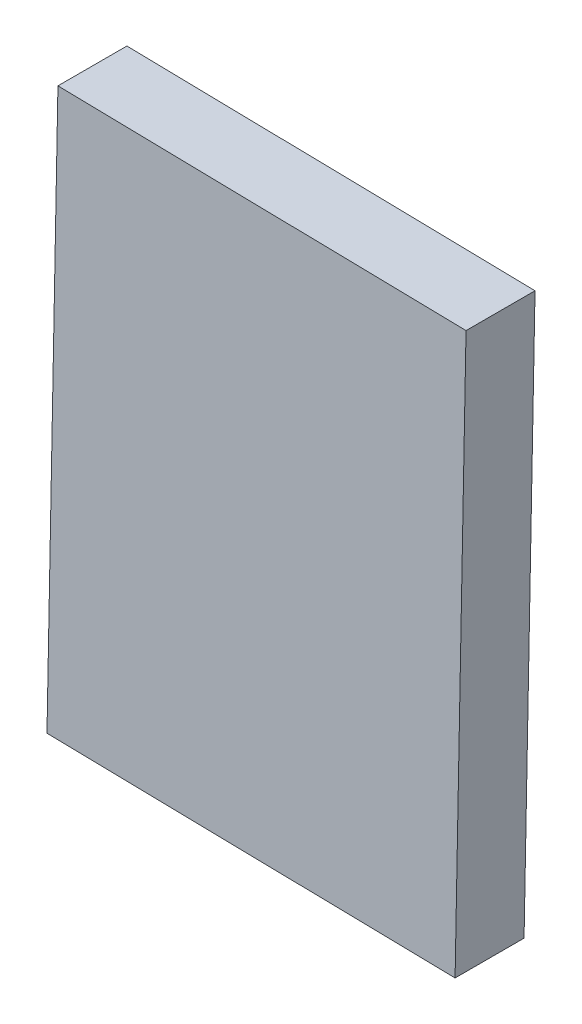
ISO-10303-21;
HEADER;
FILE_DESCRIPTION(('STEP AP214'),'2;1');
FILE_NAME('part.step','',(''),(''),'','','');
FILE_SCHEMA(('AUTOMOTIVE_DESIGN { 1 0 10303 214 1 1 1 1 }'));
ENDSEC;
DATA;
#1=APPLICATION_CONTEXT('core data for automotive mechanical design processes');
#2=APPLICATION_PROTOCOL_DEFINITION('international standard','automotive_design',2000,#1);
#3=PRODUCT_CONTEXT('',#1,'mechanical');
#4=PRODUCT('Part','Part','',(#3));
#5=PRODUCT_RELATED_PRODUCT_CATEGORY('part','',(#4));
#6=PRODUCT_DEFINITION_FORMATION('','',#4);
#7=PRODUCT_DEFINITION_CONTEXT('part definition',#1,'design');
#8=PRODUCT_DEFINITION('design','',#6,#7);
#9=PRODUCT_DEFINITION_SHAPE('','',#8);
#10=(LENGTH_UNIT() NAMED_UNIT(*) SI_UNIT(.MILLI.,.METRE.));
#11=(NAMED_UNIT(*) PLANE_ANGLE_UNIT() SI_UNIT($,.RADIAN.));
#12=(NAMED_UNIT(*) SI_UNIT($,.STERADIAN.) SOLID_ANGLE_UNIT());
#13=UNCERTAINTY_MEASURE_WITH_UNIT(LENGTH_MEASURE(1.E-05),#10,'distance_accuracy_value','');
#14=(GEOMETRIC_REPRESENTATION_CONTEXT(3) GLOBAL_UNCERTAINTY_ASSIGNED_CONTEXT((#13)) GLOBAL_UNIT_ASSIGNED_CONTEXT((#10,
#11,#12)) REPRESENTATION_CONTEXT('',''));
#15=CARTESIAN_POINT('',(0.,0.,0.));
#16=DIRECTION('',(0.,0.,1.));
#17=DIRECTION('',(1.,0.,0.));
#18=AXIS2_PLACEMENT_3D('',#15,#16,#17);
#19=CARTESIAN_POINT('',(-1.69169808418193,1.84838383607335,34.7010965279299));
#20=DIRECTION('',(0.,0.,1.));
#21=DIRECTION('',(0.999812677663925,-0.0193548335692301,0.));
#22=AXIS2_PLACEMENT_3D('',#19,#20,#21);
#23=PLANE('',#22);
#24=DIRECTION('',(0.0193548335692301,0.999812677663925,0.));
#25=VECTOR('',#24,1.);
#26=CARTESIAN_POINT('',(-10.9491282892118,-10.4842503208698,34.7010965279297));
#27=LINE('',#26,#25);
#28=CARTESIAN_POINT('',(-10.9491282892118,-10.4842503208698,34.7010965279297));
#29=VERTEX_POINT('',#28);
#30=CARTESIAN_POINT('',(-10.4648897081432,14.530063061604,34.7010965279294));
#31=VERTEX_POINT('',#30);
#32=EDGE_CURVE('E72',#29,#31,#27,.T.);
#33=ORIENTED_EDGE('',*,*,#32,.T.);
#34=DIRECTION('',(0.999812677663925,-0.0193548335692299,0.));
#35=VECTOR('',#34,1.);
#36=CARTESIAN_POINT('',(-10.4648897081432,14.530063061604,34.7010965279294));
#37=LINE('',#36,#35);
#38=CARTESIAN_POINT('',(7.56573212084797,14.1810179930165,34.70109652793));
#39=VERTEX_POINT('',#38);
#40=EDGE_CURVE('E35',#31,#39,#37,.T.);
#41=ORIENTED_EDGE('',*,*,#40,.T.);
#42=DIRECTION('',(-0.0193548335692301,-0.999812677663925,0.));
#43=VECTOR('',#42,1.);
#44=CARTESIAN_POINT('',(7.0814935397794,-10.8332953894573,34.7010965279303));
#45=LINE('',#44,#43);
#46=CARTESIAN_POINT('',(7.0814935397794,-10.8332953894573,34.7010965279303));
#47=VERTEX_POINT('',#46);
#48=EDGE_CURVE('E95',#39,#47,#45,.T.);
#49=ORIENTED_EDGE('',*,*,#48,.T.);
#50=DIRECTION('',(-0.999812677663925,0.0193548335692299,0.));
#51=VECTOR('',#50,1.);
#52=CARTESIAN_POINT('',(-10.9491282892118,-10.4842503208698,34.7010965279297));
#53=LINE('',#52,#51);
#54=EDGE_CURVE('E70',#47,#29,#53,.T.);
#55=ORIENTED_EDGE('',*,*,#54,.T.);
#56=EDGE_LOOP('',(#33,#41,#49,#55));
#57=FACE_BOUND('',#56,.T.);
#58=ADVANCED_FACE('F32',(#57),#23,.F.);
#59=CARTESIAN_POINT('',(-10.4648897081433,14.530063061604,37.7490965279294));
#60=DIRECTION('',(-0.0193548335692299,-0.999812677663925,0.));
#61=DIRECTION('',(0.999812677663925,-0.0193548335692299,0.));
#62=AXIS2_PLACEMENT_3D('',#59,#60,#61);
#63=PLANE('',#62);
#64=DIRECTION('',(0.,0.,1.));
#65=VECTOR('',#64,1.);
#66=CARTESIAN_POINT('',(7.56573212084787,14.1810179930165,37.74909652793));
#67=LINE('',#66,#65);
#68=CARTESIAN_POINT('',(7.56573212084787,14.1810179930165,37.74909652793));
#69=VERTEX_POINT('',#68);
#70=EDGE_CURVE('E83',#69,#39,#67,.F.);
#71=ORIENTED_EDGE('',*,*,#70,.T.);
#72=ORIENTED_EDGE('',*,*,#40,.F.);
#73=DIRECTION('',(0.,0.,1.));
#74=VECTOR('',#73,1.);
#75=CARTESIAN_POINT('',(-10.4648897081433,14.530063061604,37.7490965279294));
#76=LINE('',#75,#74);
#77=CARTESIAN_POINT('',(-10.4648897081433,14.530063061604,37.7490965279294));
#78=VERTEX_POINT('',#77);
#79=EDGE_CURVE('E78',#31,#78,#76,.T.);
#80=ORIENTED_EDGE('',*,*,#79,.T.);
#81=DIRECTION('',(0.999812677663925,-0.0193548335692301,0.));
#82=VECTOR('',#81,1.);
#83=CARTESIAN_POINT('',(-1.44957879364774,14.3555405273103,37.7490965279297));
#84=LINE('',#83,#82);
#85=EDGE_CURVE('E98',#69,#78,#84,.F.);
#86=ORIENTED_EDGE('',*,*,#85,.F.);
#87=EDGE_LOOP('',(#71,#72,#80,#86));
#88=FACE_BOUND('',#87,.T.);
#89=ADVANCED_FACE('F80',(#88),#63,.F.);
#90=CARTESIAN_POINT('',(-10.9491282892119,-10.4842503208697,37.7490965279298));
#91=DIRECTION('',(0.999812677663925,-0.0193548335692301,0.));
#92=DIRECTION('',(0.0193548335692301,0.999812677663925,0.));
#93=AXIS2_PLACEMENT_3D('',#90,#91,#92);
#94=PLANE('',#93);
#95=ORIENTED_EDGE('',*,*,#79,.F.);
#96=ORIENTED_EDGE('',*,*,#32,.F.);
#97=DIRECTION('',(0.,0.,1.));
#98=VECTOR('',#97,1.);
#99=CARTESIAN_POINT('',(-10.9491282892119,-10.4842503208697,37.7490965279298));
#100=LINE('',#99,#98);
#101=CARTESIAN_POINT('',(-10.9491282892119,-10.4842503208697,37.7490965279298));
#102=VERTEX_POINT('',#101);
#103=EDGE_CURVE('E90',#29,#102,#100,.T.);
#104=ORIENTED_EDGE('',*,*,#103,.T.);
#105=DIRECTION('',(0.0193548335692301,0.999812677663925,0.));
#106=VECTOR('',#105,1.);
#107=CARTESIAN_POINT('',(-10.7070089986776,2.02290637036714,37.7490965279296));
#108=LINE('',#107,#106);
#109=EDGE_CURVE('E87',#78,#102,#108,.F.);
#110=ORIENTED_EDGE('',*,*,#109,.F.);
#111=EDGE_LOOP('',(#95,#96,#104,#110));
#112=FACE_BOUND('',#111,.T.);
#113=ADVANCED_FACE('F85',(#112),#94,.F.);
#114=CARTESIAN_POINT('',(-10.9491282892119,-10.4842503208697,37.7490965279298));
#115=DIRECTION('',(0.0193548335692299,0.999812677663925,0.));
#116=DIRECTION('',(-0.999812677663925,0.0193548335692299,0.));
#117=AXIS2_PLACEMENT_3D('',#114,#115,#116);
#118=PLANE('',#117);
#119=ORIENTED_EDGE('',*,*,#103,.F.);
#120=ORIENTED_EDGE('',*,*,#54,.F.);
#121=DIRECTION('',(0.,0.,1.));
#122=VECTOR('',#121,1.);
#123=CARTESIAN_POINT('',(7.0814935397793,-10.8332953894572,37.7490965279303));
#124=LINE('',#123,#122);
#125=CARTESIAN_POINT('',(7.0814935397793,-10.8332953894572,37.7490965279303));
#126=VERTEX_POINT('',#125);
#127=EDGE_CURVE('E50',#47,#126,#124,.T.);
#128=ORIENTED_EDGE('',*,*,#127,.T.);
#129=DIRECTION('',(0.999812677663925,-0.0193548335692301,0.));
#130=VECTOR('',#129,1.);
#131=CARTESIAN_POINT('',(-1.93381737471631,-10.6587728551635,37.74909652793));
#132=LINE('',#131,#130);
#133=EDGE_CURVE('E41',#102,#126,#132,.T.);
#134=ORIENTED_EDGE('',*,*,#133,.F.);
#135=EDGE_LOOP('',(#119,#120,#128,#134));
#136=FACE_BOUND('',#135,.T.);
#137=ADVANCED_FACE('F104',(#136),#118,.F.);
#138=CARTESIAN_POINT('',(7.0814935397793,-10.8332953894572,37.7490965279303));
#139=DIRECTION('',(-0.999812677663925,0.0193548335692301,0.));
#140=DIRECTION('',(-0.0193548335692301,-0.999812677663925,0.));
#141=AXIS2_PLACEMENT_3D('',#138,#139,#140);
#142=PLANE('',#141);
#143=ORIENTED_EDGE('',*,*,#127,.F.);
#144=ORIENTED_EDGE('',*,*,#48,.F.);
#145=ORIENTED_EDGE('',*,*,#70,.F.);
#146=DIRECTION('',(0.0193548335692301,0.999812677663925,0.));
#147=VECTOR('',#146,1.);
#148=CARTESIAN_POINT('',(7.32361283031359,1.67386130177965,37.7490965279302));
#149=LINE('',#148,#147);
#150=EDGE_CURVE('E11',#126,#69,#149,.T.);
#151=ORIENTED_EDGE('',*,*,#150,.F.);
#152=EDGE_LOOP('',(#143,#144,#145,#151));
#153=FACE_BOUND('',#152,.T.);
#154=ADVANCED_FACE('F106',(#153),#142,.F.);
#155=CARTESIAN_POINT('',(-1.69169808418203,1.8483838360734,37.7490965279299));
#156=DIRECTION('',(0.,0.,1.));
#157=DIRECTION('',(0.999812677663925,-0.0193548335692301,0.));
#158=AXIS2_PLACEMENT_3D('',#155,#156,#157);
#159=PLANE('',#158);
#160=ORIENTED_EDGE('',*,*,#133,.T.);
#161=ORIENTED_EDGE('',*,*,#150,.T.);
#162=ORIENTED_EDGE('',*,*,#85,.T.);
#163=ORIENTED_EDGE('',*,*,#109,.T.);
#164=EDGE_LOOP('',(#160,#161,#162,#163));
#165=FACE_BOUND('',#164,.T.);
#166=ADVANCED_FACE('F103',(#165),#159,.T.);
#167=CLOSED_SHELL('',(#58,#89,#113,#137,#154,#166));
#168=MANIFOLD_SOLID_BREP('B2',#167);
#169=ADVANCED_BREP_SHAPE_REPRESENTATION('',(#18,#168),#14);
#170=SHAPE_DEFINITION_REPRESENTATION(#9,#169);
ENDSEC;
END-ISO-10303-21;
